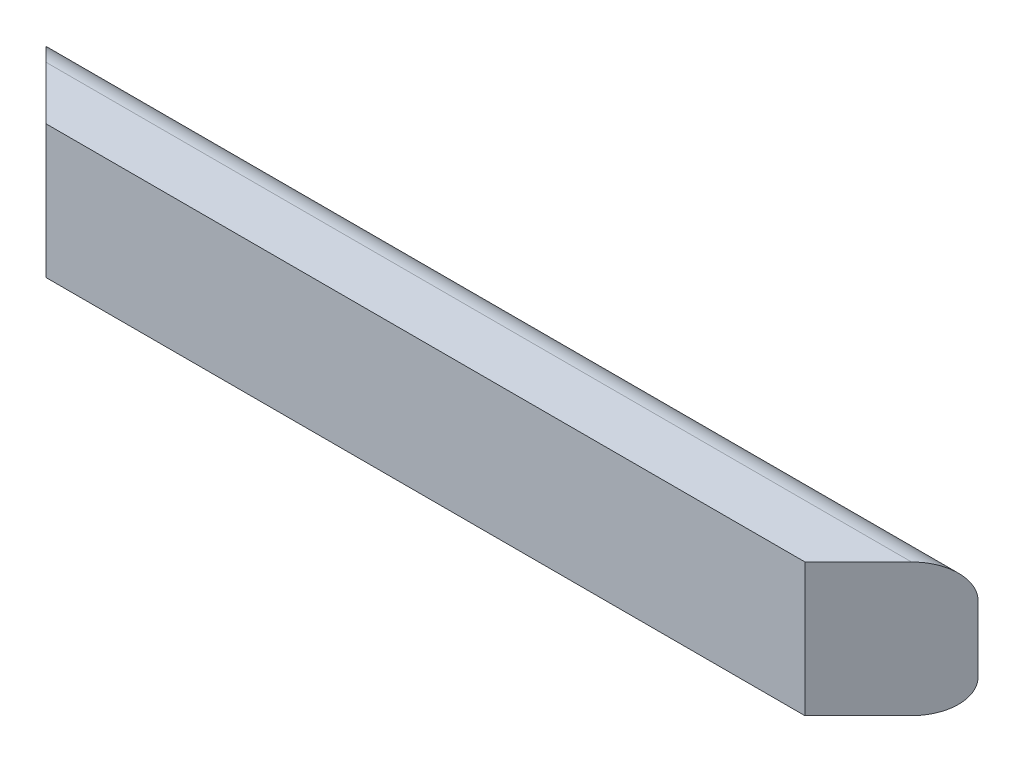
ISO-10303-21;
HEADER;
FILE_DESCRIPTION(('STEP AP214'),'2;1');
FILE_NAME('part.step','',(''),(''),'','','');
FILE_SCHEMA(('AUTOMOTIVE_DESIGN { 1 0 10303 214 1 1 1 1 }'));
ENDSEC;
DATA;
#1=APPLICATION_CONTEXT('core data for automotive mechanical design processes');
#2=APPLICATION_PROTOCOL_DEFINITION('international standard','automotive_design',2000,#1);
#3=PRODUCT_CONTEXT('',#1,'mechanical');
#4=PRODUCT('Part','Part','',(#3));
#5=PRODUCT_RELATED_PRODUCT_CATEGORY('part','',(#4));
#6=PRODUCT_DEFINITION_FORMATION('','',#4);
#7=PRODUCT_DEFINITION_CONTEXT('part definition',#1,'design');
#8=PRODUCT_DEFINITION('design','',#6,#7);
#9=PRODUCT_DEFINITION_SHAPE('','',#8);
#10=(LENGTH_UNIT() NAMED_UNIT(*) SI_UNIT(.MILLI.,.METRE.));
#11=(NAMED_UNIT(*) PLANE_ANGLE_UNIT() SI_UNIT($,.RADIAN.));
#12=(NAMED_UNIT(*) SI_UNIT($,.STERADIAN.) SOLID_ANGLE_UNIT());
#13=UNCERTAINTY_MEASURE_WITH_UNIT(LENGTH_MEASURE(1.E-05),#10,'distance_accuracy_value','');
#14=(GEOMETRIC_REPRESENTATION_CONTEXT(3) GLOBAL_UNCERTAINTY_ASSIGNED_CONTEXT((#13)) GLOBAL_UNIT_ASSIGNED_CONTEXT((#10,
#11,#12)) REPRESENTATION_CONTEXT('',''));
#15=CARTESIAN_POINT('',(0.,0.,0.));
#16=DIRECTION('',(0.,0.,1.));
#17=DIRECTION('',(1.,0.,0.));
#18=AXIS2_PLACEMENT_3D('',#15,#16,#17);
#19=CARTESIAN_POINT('',(888.6444,0.,0.));
#20=DIRECTION('',(0.,1.,0.));
#21=DIRECTION('',(0.,0.,1.));
#22=AXIS2_PLACEMENT_3D('',#19,#20,#21);
#23=PLANE('',#22);
#24=DIRECTION('',(-1.,0.,0.));
#25=VECTOR('',#24,1.);
#26=CARTESIAN_POINT('',(888.6444,0.,19.05));
#27=LINE('',#26,#25);
#28=CARTESIAN_POINT('',(806.0944,0.,19.05));
#29=VERTEX_POINT('',#28);
#30=CARTESIAN_POINT('',(82.5500000000001,0.,19.05));
#31=VERTEX_POINT('',#30);
#32=EDGE_CURVE('E127',#29,#31,#27,.T.);
#33=ORIENTED_EDGE('',*,*,#32,.T.);
#34=DIRECTION('',(-0.707106781186549,0.,-0.707106781186546));
#35=VECTOR('',#34,1.);
#36=CARTESIAN_POINT('',(476.072200000001,0.,412.5722));
#37=LINE('',#36,#35);
#38=CARTESIAN_POINT('',(31.7499999999997,0.,-31.7500000000001));
#39=VERTEX_POINT('',#38);
#40=EDGE_CURVE('E110',#31,#39,#37,.T.);
#41=ORIENTED_EDGE('',*,*,#40,.T.);
#42=DIRECTION('',(-1.,0.,0.));
#43=VECTOR('',#42,1.);
#44=CARTESIAN_POINT('',(888.6444,0.,-31.75));
#45=LINE('',#44,#43);
#46=CARTESIAN_POINT('',(856.8944,0.,-31.75));
#47=VERTEX_POINT('',#46);
#48=EDGE_CURVE('E11',#47,#39,#45,.T.);
#49=ORIENTED_EDGE('',*,*,#48,.F.);
#50=DIRECTION('',(-0.707106781186549,0.,0.707106781186546));
#51=VECTOR('',#50,1.);
#52=CARTESIAN_POINT('',(856.8944,0.,-31.7499999999999));
#53=LINE('',#52,#51);
#54=EDGE_CURVE('E135',#47,#29,#53,.T.);
#55=ORIENTED_EDGE('',*,*,#54,.T.);
#56=EDGE_LOOP('',(#33,#41,#49,#55));
#57=FACE_BOUND('',#56,.T.);
#58=ADVANCED_FACE('F38',(#57),#23,.F.);
#59=CARTESIAN_POINT('',(888.6444,31.75,-31.75));
#60=DIRECTION('',(-1.,0.,0.));
#61=DIRECTION('',(0.,0.,1.));
#62=AXIS2_PLACEMENT_3D('',#59,#60,#61);
#63=CYLINDRICAL_SURFACE('',#62,31.75);
#64=ORIENTED_EDGE('',*,*,#48,.T.);
#65=CARTESIAN_POINT('',(31.7499999999998,31.75,-31.75));
#66=DIRECTION('',(0.707106781186546,0.,-0.707106781186549));
#67=DIRECTION('',(-0.707106781186549,0.,-0.707106781186546));
#68=AXIS2_PLACEMENT_3D('',#65,#66,#67);
#69=ELLIPSE('',#68,44.9012806053459,31.75);
#70=CARTESIAN_POINT('',(0.,31.75,-63.4999999999997));
#71=VERTEX_POINT('',#70);
#72=EDGE_CURVE('E95',#39,#71,#69,.T.);
#73=ORIENTED_EDGE('',*,*,#72,.T.);
#74=DIRECTION('',(-1.,0.,0.));
#75=VECTOR('',#74,1.);
#76=CARTESIAN_POINT('',(888.6444,31.75,-63.5));
#77=LINE('',#76,#75);
#78=CARTESIAN_POINT('',(888.6444,31.75,-63.5));
#79=VERTEX_POINT('',#78);
#80=EDGE_CURVE('E47',#79,#71,#77,.T.);
#81=ORIENTED_EDGE('',*,*,#80,.F.);
#82=CARTESIAN_POINT('',(856.8944,31.75,-31.75));
#83=DIRECTION('',(-0.707106781186546,0.,-0.707106781186549));
#84=DIRECTION('',(-0.707106781186549,0.,0.707106781186546));
#85=AXIS2_PLACEMENT_3D('',#82,#83,#84);
#86=ELLIPSE('',#85,44.9012806053459,31.75);
#87=EDGE_CURVE('E56',#79,#47,#86,.T.);
#88=ORIENTED_EDGE('',*,*,#87,.T.);
#89=EDGE_LOOP('',(#64,#73,#81,#88));
#90=FACE_BOUND('',#89,.T.);
#91=ADVANCED_FACE('F106',(#90),#63,.T.);
#92=CARTESIAN_POINT('',(888.6444,95.25,-63.5));
#93=DIRECTION('',(0.,0.,1.));
#94=DIRECTION('',(1.,0.,0.));
#95=AXIS2_PLACEMENT_3D('',#92,#93,#94);
#96=PLANE('',#95);
#97=DIRECTION('',(0.,1.,0.));
#98=VECTOR('',#97,1.);
#99=CARTESIAN_POINT('',(0.,95.25,-63.5));
#100=LINE('',#99,#98);
#101=CARTESIAN_POINT('',(0.,95.25,-63.5));
#102=VERTEX_POINT('',#101);
#103=EDGE_CURVE('E92',#71,#102,#100,.T.);
#104=ORIENTED_EDGE('',*,*,#103,.T.);
#105=DIRECTION('',(-1.,0.,0.));
#106=VECTOR('',#105,1.);
#107=CARTESIAN_POINT('',(888.6444,95.25,-63.5));
#108=LINE('',#107,#106);
#109=CARTESIAN_POINT('',(888.6444,95.25,-63.4999999999997));
#110=VERTEX_POINT('',#109);
#111=EDGE_CURVE('E114',#110,#102,#108,.T.);
#112=ORIENTED_EDGE('',*,*,#111,.F.);
#113=DIRECTION('',(0.,1.,0.));
#114=VECTOR('',#113,1.);
#115=CARTESIAN_POINT('',(888.6444,95.25,-63.5));
#116=LINE('',#115,#114);
#117=EDGE_CURVE('E103',#79,#110,#116,.T.);
#118=ORIENTED_EDGE('',*,*,#117,.F.);
#119=ORIENTED_EDGE('',*,*,#80,.T.);
#120=EDGE_LOOP('',(#104,#112,#118,#119));
#121=FACE_BOUND('',#120,.T.);
#122=ADVANCED_FACE('F112',(#121),#96,.F.);
#123=CARTESIAN_POINT('',(888.6444,95.25,-31.75));
#124=DIRECTION('',(-1.,0.,0.));
#125=DIRECTION('',(0.,0.,1.));
#126=AXIS2_PLACEMENT_3D('',#123,#124,#125);
#127=CYLINDRICAL_SURFACE('',#126,31.75);
#128=ORIENTED_EDGE('',*,*,#111,.T.);
#129=CARTESIAN_POINT('',(31.7499999999998,95.25,-31.75));
#130=DIRECTION('',(0.707106781186546,0.,-0.707106781186549));
#131=DIRECTION('',(-0.707106781186549,0.,-0.707106781186546));
#132=AXIS2_PLACEMENT_3D('',#129,#130,#131);
#133=ELLIPSE('',#132,44.9012806053459,31.75);
#134=CARTESIAN_POINT('',(31.7499999999998,127.,-31.75));
#135=VERTEX_POINT('',#134);
#136=EDGE_CURVE('E98',#102,#135,#133,.T.);
#137=ORIENTED_EDGE('',*,*,#136,.T.);
#138=DIRECTION('',(-1.,0.,0.));
#139=VECTOR('',#138,1.);
#140=CARTESIAN_POINT('',(888.6444,127.,-31.75));
#141=LINE('',#140,#139);
#142=CARTESIAN_POINT('',(856.8944,127.,-31.75));
#143=VERTEX_POINT('',#142);
#144=EDGE_CURVE('E117',#143,#135,#141,.T.);
#145=ORIENTED_EDGE('',*,*,#144,.F.);
#146=CARTESIAN_POINT('',(856.8944,95.25,-31.75));
#147=DIRECTION('',(-0.707106781186546,0.,-0.707106781186549));
#148=DIRECTION('',(-0.707106781186549,0.,0.707106781186546));
#149=AXIS2_PLACEMENT_3D('',#146,#147,#148);
#150=ELLIPSE('',#149,44.9012806053459,31.75);
#151=EDGE_CURVE('E109',#143,#110,#150,.T.);
#152=ORIENTED_EDGE('',*,*,#151,.T.);
#153=EDGE_LOOP('',(#128,#137,#145,#152));
#154=FACE_BOUND('',#153,.T.);
#155=ADVANCED_FACE('F160',(#154),#127,.T.);
#156=CARTESIAN_POINT('',(888.6444,127.,19.05));
#157=DIRECTION('',(0.,-1.,0.));
#158=DIRECTION('',(0.,0.,-1.));
#159=AXIS2_PLACEMENT_3D('',#156,#157,#158);
#160=PLANE('',#159);
#161=ORIENTED_EDGE('',*,*,#144,.T.);
#162=DIRECTION('',(0.707106781186549,0.,0.707106781186546));
#163=VECTOR('',#162,1.);
#164=CARTESIAN_POINT('',(485.597200000002,127.000000000001,422.0972));
#165=LINE('',#164,#163);
#166=CARTESIAN_POINT('',(82.5500000000001,127.,19.0500000000001));
#167=VERTEX_POINT('',#166);
#168=EDGE_CURVE('E153',#135,#167,#165,.T.);
#169=ORIENTED_EDGE('',*,*,#168,.T.);
#170=DIRECTION('',(-1.,0.,0.));
#171=VECTOR('',#170,1.);
#172=CARTESIAN_POINT('',(888.6444,127.,19.05));
#173=LINE('',#172,#171);
#174=CARTESIAN_POINT('',(806.0944,127.,19.05));
#175=VERTEX_POINT('',#174);
#176=EDGE_CURVE('E123',#175,#167,#173,.T.);
#177=ORIENTED_EDGE('',*,*,#176,.F.);
#178=DIRECTION('',(0.707106781186549,0.,-0.707106781186546));
#179=VECTOR('',#178,1.);
#180=CARTESIAN_POINT('',(847.3694,127.,-22.225));
#181=LINE('',#180,#179);
#182=EDGE_CURVE('E142',#175,#143,#181,.T.);
#183=ORIENTED_EDGE('',*,*,#182,.T.);
#184=EDGE_LOOP('',(#161,#169,#177,#183));
#185=FACE_BOUND('',#184,.T.);
#186=ADVANCED_FACE('F162',(#185),#160,.F.);
#187=CARTESIAN_POINT('',(888.6444,0.,19.05));
#188=DIRECTION('',(0.,0.,-1.));
#189=DIRECTION('',(-1.,0.,0.));
#190=AXIS2_PLACEMENT_3D('',#187,#188,#189);
#191=PLANE('',#190);
#192=ORIENTED_EDGE('',*,*,#176,.T.);
#193=DIRECTION('',(0.,-1.,0.));
#194=VECTOR('',#193,1.);
#195=CARTESIAN_POINT('',(82.5500000000001,0.,19.05));
#196=LINE('',#195,#194);
#197=EDGE_CURVE('E150',#167,#31,#196,.T.);
#198=ORIENTED_EDGE('',*,*,#197,.T.);
#199=ORIENTED_EDGE('',*,*,#32,.F.);
#200=DIRECTION('',(0.,1.,0.));
#201=VECTOR('',#200,1.);
#202=CARTESIAN_POINT('',(806.0944,0.,19.05));
#203=LINE('',#202,#201);
#204=EDGE_CURVE('E139',#29,#175,#203,.T.);
#205=ORIENTED_EDGE('',*,*,#204,.T.);
#206=EDGE_LOOP('',(#192,#198,#199,#205));
#207=FACE_BOUND('',#206,.T.);
#208=ADVANCED_FACE('F167',(#207),#191,.F.);
#209=CARTESIAN_POINT('',(412.572199999999,0.,412.5722));
#210=DIRECTION('',(-0.707106781186546,0.,-0.707106781186549));
#211=DIRECTION('',(-0.707106781186549,0.,0.707106781186546));
#212=AXIS2_PLACEMENT_3D('',#209,#210,#211);
#213=PLANE('',#212);
#214=ORIENTED_EDGE('',*,*,#117,.T.);
#215=ORIENTED_EDGE('',*,*,#151,.F.);
#216=ORIENTED_EDGE('',*,*,#182,.F.);
#217=ORIENTED_EDGE('',*,*,#204,.F.);
#218=ORIENTED_EDGE('',*,*,#54,.F.);
#219=ORIENTED_EDGE('',*,*,#87,.F.);
#220=EDGE_LOOP('',(#214,#215,#216,#217,#218,#219));
#221=FACE_BOUND('',#220,.T.);
#222=ADVANCED_FACE('F164',(#221),#213,.F.);
#223=CARTESIAN_POINT('',(476.072200000001,0.,412.5722));
#224=DIRECTION('',(0.707106781186546,0.,-0.707106781186549));
#225=DIRECTION('',(0.707106781186549,0.,0.707106781186546));
#226=AXIS2_PLACEMENT_3D('',#223,#224,#225);
#227=PLANE('',#226);
#228=ORIENTED_EDGE('',*,*,#40,.F.);
#229=ORIENTED_EDGE('',*,*,#197,.F.);
#230=ORIENTED_EDGE('',*,*,#168,.F.);
#231=ORIENTED_EDGE('',*,*,#136,.F.);
#232=ORIENTED_EDGE('',*,*,#103,.F.);
#233=ORIENTED_EDGE('',*,*,#72,.F.);
#234=EDGE_LOOP('',(#228,#229,#230,#231,#232,#233));
#235=FACE_BOUND('',#234,.T.);
#236=ADVANCED_FACE('F94',(#235),#227,.F.);
#237=CLOSED_SHELL('',(#58,#91,#122,#155,#186,#208,#222,#236));
#238=MANIFOLD_SOLID_BREP('B2',#237);
#239=ADVANCED_BREP_SHAPE_REPRESENTATION('',(#18,#238),#14);
#240=SHAPE_DEFINITION_REPRESENTATION(#9,#239);
ENDSEC;
END-ISO-10303-21;
